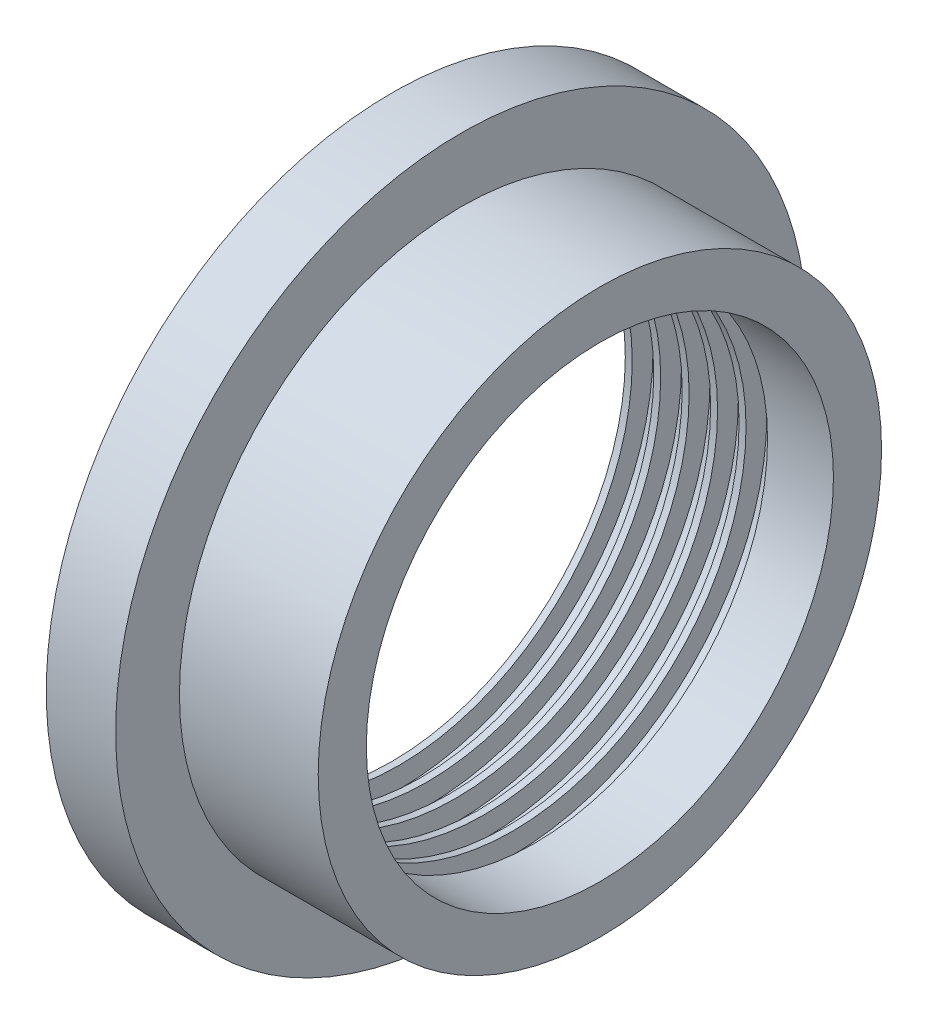
ISO-10303-21;
HEADER;
FILE_DESCRIPTION(('STEP AP214'),'2;1');
FILE_NAME('part.step','',(''),(''),'','','');
FILE_SCHEMA(('AUTOMOTIVE_DESIGN { 1 0 10303 214 1 1 1 1 }'));
ENDSEC;
DATA;
#1=APPLICATION_CONTEXT('core data for automotive mechanical design processes');
#2=APPLICATION_PROTOCOL_DEFINITION('international standard','automotive_design',2000,#1);
#3=PRODUCT_CONTEXT('',#1,'mechanical');
#4=PRODUCT('Part','Part','',(#3));
#5=PRODUCT_RELATED_PRODUCT_CATEGORY('part','',(#4));
#6=PRODUCT_DEFINITION_FORMATION('','',#4);
#7=PRODUCT_DEFINITION_CONTEXT('part definition',#1,'design');
#8=PRODUCT_DEFINITION('design','',#6,#7);
#9=PRODUCT_DEFINITION_SHAPE('','',#8);
#10=(LENGTH_UNIT() NAMED_UNIT(*) SI_UNIT(.MILLI.,.METRE.));
#11=(NAMED_UNIT(*) PLANE_ANGLE_UNIT() SI_UNIT($,.RADIAN.));
#12=(NAMED_UNIT(*) SI_UNIT($,.STERADIAN.) SOLID_ANGLE_UNIT());
#13=UNCERTAINTY_MEASURE_WITH_UNIT(LENGTH_MEASURE(1.E-05),#10,'distance_accuracy_value','');
#14=(GEOMETRIC_REPRESENTATION_CONTEXT(3) GLOBAL_UNCERTAINTY_ASSIGNED_CONTEXT((#13)) GLOBAL_UNIT_ASSIGNED_CONTEXT((#10,
#11,#12)) REPRESENTATION_CONTEXT('',''));
#15=CARTESIAN_POINT('',(0.,0.,0.));
#16=DIRECTION('',(0.,0.,1.));
#17=DIRECTION('',(1.,0.,0.));
#18=AXIS2_PLACEMENT_3D('',#15,#16,#17);
#19=CARTESIAN_POINT('',(0.,0.,0.));
#20=DIRECTION('',(1.,0.,0.));
#21=DIRECTION('',(0.,0.,-1.));
#22=AXIS2_PLACEMENT_3D('',#19,#20,#21);
#23=CYLINDRICAL_SURFACE('',#22,12.6492);
#24=CARTESIAN_POINT('',(-7.62,0.,0.));
#25=DIRECTION('',(1.,0.,0.));
#26=DIRECTION('',(0.,0.,-1.));
#27=AXIS2_PLACEMENT_3D('',#24,#25,#26);
#28=CIRCLE('',#27,12.6492);
#29=CARTESIAN_POINT('',(-7.62,0.,-12.6492));
#30=VERTEX_POINT('',#29);
#31=EDGE_CURVE('E10',#30,#30,#28,.T.);
#32=ORIENTED_EDGE('',*,*,#31,.T.);
#33=EDGE_LOOP('',(#32));
#34=FACE_BOUND('',#33,.T.);
#35=CARTESIAN_POINT('',(-5.08,0.,0.));
#36=DIRECTION('',(1.,0.,0.));
#37=DIRECTION('',(0.,0.,-1.));
#38=AXIS2_PLACEMENT_3D('',#35,#36,#37);
#39=CIRCLE('',#38,12.6492);
#40=CARTESIAN_POINT('',(-5.08,0.,-12.6492));
#41=VERTEX_POINT('',#40);
#42=EDGE_CURVE('E118',#41,#41,#39,.T.);
#43=ORIENTED_EDGE('',*,*,#42,.F.);
#44=EDGE_LOOP('',(#43));
#45=FACE_BOUND('',#44,.T.);
#46=ADVANCED_FACE('F36',(#34,#45),#23,.T.);
#47=CARTESIAN_POINT('',(-7.62,12.6492,0.));
#48=DIRECTION('',(-1.,0.,0.));
#49=DIRECTION('',(0.,0.,1.));
#50=AXIS2_PLACEMENT_3D('',#47,#48,#49);
#51=PLANE('',#50);
#52=CARTESIAN_POINT('',(-7.62,0.,0.));
#53=DIRECTION('',(1.,0.,0.));
#54=DIRECTION('',(0.,0.,-1.));
#55=AXIS2_PLACEMENT_3D('',#52,#53,#54);
#56=CIRCLE('',#55,8.550800018);
#57=CARTESIAN_POINT('',(-7.62,0.,-8.550800018));
#58=VERTEX_POINT('',#57);
#59=EDGE_CURVE('E42',#58,#58,#56,.T.);
#60=ORIENTED_EDGE('',*,*,#59,.T.);
#61=EDGE_LOOP('',(#60));
#62=FACE_BOUND('',#61,.T.);
#63=ORIENTED_EDGE('',*,*,#31,.F.);
#64=EDGE_LOOP('',(#63));
#65=FACE_BOUND('',#64,.T.);
#66=ADVANCED_FACE('F126',(#62,#65),#51,.T.);
#67=CARTESIAN_POINT('',(0.,0.,0.));
#68=DIRECTION('',(1.,0.,0.));
#69=DIRECTION('',(0.,0.,-1.));
#70=AXIS2_PLACEMENT_3D('',#67,#68,#69);
#71=CYLINDRICAL_SURFACE('',#70,8.550800018);
#72=CARTESIAN_POINT('',(-7.366,0.,0.));
#73=DIRECTION('',(1.,0.,0.));
#74=DIRECTION('',(0.,0.,-1.));
#75=AXIS2_PLACEMENT_3D('',#72,#73,#74);
#76=CIRCLE('',#75,8.550800018);
#77=CARTESIAN_POINT('',(-7.366,0.,-8.550800018));
#78=VERTEX_POINT('',#77);
#79=EDGE_CURVE('E46',#78,#78,#76,.T.);
#80=ORIENTED_EDGE('',*,*,#79,.T.);
#81=EDGE_LOOP('',(#80));
#82=FACE_BOUND('',#81,.T.);
#83=ORIENTED_EDGE('',*,*,#59,.F.);
#84=EDGE_LOOP('',(#83));
#85=FACE_BOUND('',#84,.T.);
#86=ADVANCED_FACE('F130',(#82,#85),#71,.F.);
#87=CARTESIAN_POINT('',(-7.366,8.550800018,0.));
#88=DIRECTION('',(1.,0.,0.));
#89=DIRECTION('',(0.,0.,-1.));
#90=AXIS2_PLACEMENT_3D('',#87,#88,#89);
#91=PLANE('',#90);
#92=CARTESIAN_POINT('',(-7.366,0.,0.));
#93=DIRECTION('',(1.,0.,0.));
#94=DIRECTION('',(0.,0.,-1.));
#95=AXIS2_PLACEMENT_3D('',#92,#93,#94);
#96=CIRCLE('',#95,9.312800018);
#97=CARTESIAN_POINT('',(-7.366,0.,-9.312800018));
#98=VERTEX_POINT('',#97);
#99=EDGE_CURVE('E50',#98,#98,#96,.T.);
#100=ORIENTED_EDGE('',*,*,#99,.T.);
#101=EDGE_LOOP('',(#100));
#102=FACE_BOUND('',#101,.T.);
#103=ORIENTED_EDGE('',*,*,#79,.F.);
#104=EDGE_LOOP('',(#103));
#105=FACE_BOUND('',#104,.T.);
#106=ADVANCED_FACE('F134',(#102,#105),#91,.T.);
#107=CARTESIAN_POINT('',(0.,0.,0.));
#108=DIRECTION('',(1.,0.,0.));
#109=DIRECTION('',(0.,0.,-1.));
#110=AXIS2_PLACEMENT_3D('',#107,#108,#109);
#111=CYLINDRICAL_SURFACE('',#110,9.312800018);
#112=CARTESIAN_POINT('',(-6.5786,0.,0.));
#113=DIRECTION('',(1.,0.,0.));
#114=DIRECTION('',(0.,0.,-1.));
#115=AXIS2_PLACEMENT_3D('',#112,#113,#114);
#116=CIRCLE('',#115,9.312800018);
#117=CARTESIAN_POINT('',(-6.5786,0.,-9.312800018));
#118=VERTEX_POINT('',#117);
#119=EDGE_CURVE('E55',#118,#118,#116,.T.);
#120=ORIENTED_EDGE('',*,*,#119,.T.);
#121=EDGE_LOOP('',(#120));
#122=FACE_BOUND('',#121,.T.);
#123=ORIENTED_EDGE('',*,*,#99,.F.);
#124=EDGE_LOOP('',(#123));
#125=FACE_BOUND('',#124,.T.);
#126=ADVANCED_FACE('F141',(#122,#125),#111,.F.);
#127=CARTESIAN_POINT('',(-6.5786,9.312800018,0.));
#128=DIRECTION('',(-1.,0.,0.));
#129=DIRECTION('',(0.,0.,1.));
#130=AXIS2_PLACEMENT_3D('',#127,#128,#129);
#131=PLANE('',#130);
#132=CARTESIAN_POINT('',(-6.5786,0.,0.));
#133=DIRECTION('',(1.,0.,0.));
#134=DIRECTION('',(0.,0.,-1.));
#135=AXIS2_PLACEMENT_3D('',#132,#133,#134);
#136=CIRCLE('',#135,8.550800018);
#137=CARTESIAN_POINT('',(-6.5786,0.,-8.550800018));
#138=VERTEX_POINT('',#137);
#139=EDGE_CURVE('E58',#138,#138,#136,.T.);
#140=ORIENTED_EDGE('',*,*,#139,.T.);
#141=EDGE_LOOP('',(#140));
#142=FACE_BOUND('',#141,.T.);
#143=ORIENTED_EDGE('',*,*,#119,.F.);
#144=EDGE_LOOP('',(#143));
#145=FACE_BOUND('',#144,.T.);
#146=ADVANCED_FACE('F145',(#142,#145),#131,.T.);
#147=CARTESIAN_POINT('',(0.,0.,0.));
#148=DIRECTION('',(1.,0.,0.));
#149=DIRECTION('',(0.,0.,-1.));
#150=AXIS2_PLACEMENT_3D('',#147,#148,#149);
#151=CYLINDRICAL_SURFACE('',#150,8.550800018);
#152=CARTESIAN_POINT('',(-6.3246,0.,0.));
#153=DIRECTION('',(1.,0.,0.));
#154=DIRECTION('',(0.,0.,-1.));
#155=AXIS2_PLACEMENT_3D('',#152,#153,#154);
#156=CIRCLE('',#155,8.550800018);
#157=CARTESIAN_POINT('',(-6.3246,0.,-8.550800018));
#158=VERTEX_POINT('',#157);
#159=EDGE_CURVE('E61',#158,#158,#156,.T.);
#160=ORIENTED_EDGE('',*,*,#159,.T.);
#161=EDGE_LOOP('',(#160));
#162=FACE_BOUND('',#161,.T.);
#163=ORIENTED_EDGE('',*,*,#139,.F.);
#164=EDGE_LOOP('',(#163));
#165=FACE_BOUND('',#164,.T.);
#166=ADVANCED_FACE('F149',(#162,#165),#151,.F.);
#167=CARTESIAN_POINT('',(-6.3246,8.550800018,0.));
#168=DIRECTION('',(1.,0.,0.));
#169=DIRECTION('',(0.,0.,-1.));
#170=AXIS2_PLACEMENT_3D('',#167,#168,#169);
#171=PLANE('',#170);
#172=CARTESIAN_POINT('',(-6.3246,0.,0.));
#173=DIRECTION('',(1.,0.,0.));
#174=DIRECTION('',(0.,0.,-1.));
#175=AXIS2_PLACEMENT_3D('',#172,#173,#174);
#176=CIRCLE('',#175,9.312800018);
#177=CARTESIAN_POINT('',(-6.3246,0.,-9.312800018));
#178=VERTEX_POINT('',#177);
#179=EDGE_CURVE('E64',#178,#178,#176,.T.);
#180=ORIENTED_EDGE('',*,*,#179,.T.);
#181=EDGE_LOOP('',(#180));
#182=FACE_BOUND('',#181,.T.);
#183=ORIENTED_EDGE('',*,*,#159,.F.);
#184=EDGE_LOOP('',(#183));
#185=FACE_BOUND('',#184,.T.);
#186=ADVANCED_FACE('F153',(#182,#185),#171,.T.);
#187=CARTESIAN_POINT('',(0.,0.,0.));
#188=DIRECTION('',(1.,0.,0.));
#189=DIRECTION('',(0.,0.,-1.));
#190=AXIS2_PLACEMENT_3D('',#187,#188,#189);
#191=CYLINDRICAL_SURFACE('',#190,9.312800018);
#192=CARTESIAN_POINT('',(-5.5372,0.,0.));
#193=DIRECTION('',(1.,0.,0.));
#194=DIRECTION('',(0.,0.,-1.));
#195=AXIS2_PLACEMENT_3D('',#192,#193,#194);
#196=CIRCLE('',#195,9.312800018);
#197=CARTESIAN_POINT('',(-5.5372,0.,-9.312800018));
#198=VERTEX_POINT('',#197);
#199=EDGE_CURVE('E67',#198,#198,#196,.T.);
#200=ORIENTED_EDGE('',*,*,#199,.T.);
#201=EDGE_LOOP('',(#200));
#202=FACE_BOUND('',#201,.T.);
#203=ORIENTED_EDGE('',*,*,#179,.F.);
#204=EDGE_LOOP('',(#203));
#205=FACE_BOUND('',#204,.T.);
#206=ADVANCED_FACE('F157',(#202,#205),#191,.F.);
#207=CARTESIAN_POINT('',(-5.5372,9.312800018,0.));
#208=DIRECTION('',(-1.,0.,0.));
#209=DIRECTION('',(0.,0.,1.));
#210=AXIS2_PLACEMENT_3D('',#207,#208,#209);
#211=PLANE('',#210);
#212=CARTESIAN_POINT('',(-5.5372,0.,0.));
#213=DIRECTION('',(1.,0.,0.));
#214=DIRECTION('',(0.,0.,-1.));
#215=AXIS2_PLACEMENT_3D('',#212,#213,#214);
#216=CIRCLE('',#215,8.550800018);
#217=CARTESIAN_POINT('',(-5.5372,0.,-8.550800018));
#218=VERTEX_POINT('',#217);
#219=EDGE_CURVE('E70',#218,#218,#216,.T.);
#220=ORIENTED_EDGE('',*,*,#219,.T.);
#221=EDGE_LOOP('',(#220));
#222=FACE_BOUND('',#221,.T.);
#223=ORIENTED_EDGE('',*,*,#199,.F.);
#224=EDGE_LOOP('',(#223));
#225=FACE_BOUND('',#224,.T.);
#226=ADVANCED_FACE('F161',(#222,#225),#211,.T.);
#227=CARTESIAN_POINT('',(0.,0.,0.));
#228=DIRECTION('',(1.,0.,0.));
#229=DIRECTION('',(0.,0.,-1.));
#230=AXIS2_PLACEMENT_3D('',#227,#228,#229);
#231=CYLINDRICAL_SURFACE('',#230,8.550800018);
#232=CARTESIAN_POINT('',(-5.2832,0.,0.));
#233=DIRECTION('',(1.,0.,0.));
#234=DIRECTION('',(0.,0.,-1.));
#235=AXIS2_PLACEMENT_3D('',#232,#233,#234);
#236=CIRCLE('',#235,8.550800018);
#237=CARTESIAN_POINT('',(-5.2832,0.,-8.550800018));
#238=VERTEX_POINT('',#237);
#239=EDGE_CURVE('E73',#238,#238,#236,.T.);
#240=ORIENTED_EDGE('',*,*,#239,.T.);
#241=EDGE_LOOP('',(#240));
#242=FACE_BOUND('',#241,.T.);
#243=ORIENTED_EDGE('',*,*,#219,.F.);
#244=EDGE_LOOP('',(#243));
#245=FACE_BOUND('',#244,.T.);
#246=ADVANCED_FACE('F165',(#242,#245),#231,.F.);
#247=CARTESIAN_POINT('',(-5.2832,8.550800018,0.));
#248=DIRECTION('',(1.,0.,0.));
#249=DIRECTION('',(0.,0.,-1.));
#250=AXIS2_PLACEMENT_3D('',#247,#248,#249);
#251=PLANE('',#250);
#252=CARTESIAN_POINT('',(-5.2832,0.,0.));
#253=DIRECTION('',(1.,0.,0.));
#254=DIRECTION('',(0.,0.,-1.));
#255=AXIS2_PLACEMENT_3D('',#252,#253,#254);
#256=CIRCLE('',#255,9.312800018);
#257=CARTESIAN_POINT('',(-5.2832,0.,-9.312800018));
#258=VERTEX_POINT('',#257);
#259=EDGE_CURVE('E76',#258,#258,#256,.T.);
#260=ORIENTED_EDGE('',*,*,#259,.T.);
#261=EDGE_LOOP('',(#260));
#262=FACE_BOUND('',#261,.T.);
#263=ORIENTED_EDGE('',*,*,#239,.F.);
#264=EDGE_LOOP('',(#263));
#265=FACE_BOUND('',#264,.T.);
#266=ADVANCED_FACE('F169',(#262,#265),#251,.T.);
#267=CARTESIAN_POINT('',(0.,0.,0.));
#268=DIRECTION('',(1.,0.,0.));
#269=DIRECTION('',(0.,0.,-1.));
#270=AXIS2_PLACEMENT_3D('',#267,#268,#269);
#271=CYLINDRICAL_SURFACE('',#270,9.312800018);
#272=CARTESIAN_POINT('',(-4.4958,0.,0.));
#273=DIRECTION('',(1.,0.,0.));
#274=DIRECTION('',(0.,0.,-1.));
#275=AXIS2_PLACEMENT_3D('',#272,#273,#274);
#276=CIRCLE('',#275,9.312800018);
#277=CARTESIAN_POINT('',(-4.4958,0.,-9.312800018));
#278=VERTEX_POINT('',#277);
#279=EDGE_CURVE('E79',#278,#278,#276,.T.);
#280=ORIENTED_EDGE('',*,*,#279,.T.);
#281=EDGE_LOOP('',(#280));
#282=FACE_BOUND('',#281,.T.);
#283=ORIENTED_EDGE('',*,*,#259,.F.);
#284=EDGE_LOOP('',(#283));
#285=FACE_BOUND('',#284,.T.);
#286=ADVANCED_FACE('F173',(#282,#285),#271,.F.);
#287=CARTESIAN_POINT('',(-4.4958,9.312800018,0.));
#288=DIRECTION('',(-1.,0.,0.));
#289=DIRECTION('',(0.,0.,1.));
#290=AXIS2_PLACEMENT_3D('',#287,#288,#289);
#291=PLANE('',#290);
#292=CARTESIAN_POINT('',(-4.4958,0.,0.));
#293=DIRECTION('',(1.,0.,0.));
#294=DIRECTION('',(0.,0.,-1.));
#295=AXIS2_PLACEMENT_3D('',#292,#293,#294);
#296=CIRCLE('',#295,8.550800018);
#297=CARTESIAN_POINT('',(-4.4958,0.,-8.550800018));
#298=VERTEX_POINT('',#297);
#299=EDGE_CURVE('E82',#298,#298,#296,.T.);
#300=ORIENTED_EDGE('',*,*,#299,.T.);
#301=EDGE_LOOP('',(#300));
#302=FACE_BOUND('',#301,.T.);
#303=ORIENTED_EDGE('',*,*,#279,.F.);
#304=EDGE_LOOP('',(#303));
#305=FACE_BOUND('',#304,.T.);
#306=ADVANCED_FACE('F177',(#302,#305),#291,.T.);
#307=CARTESIAN_POINT('',(0.,0.,0.));
#308=DIRECTION('',(1.,0.,0.));
#309=DIRECTION('',(0.,0.,-1.));
#310=AXIS2_PLACEMENT_3D('',#307,#308,#309);
#311=CYLINDRICAL_SURFACE('',#310,8.550800018);
#312=CARTESIAN_POINT('',(-4.2418,0.,0.));
#313=DIRECTION('',(1.,0.,0.));
#314=DIRECTION('',(0.,0.,-1.));
#315=AXIS2_PLACEMENT_3D('',#312,#313,#314);
#316=CIRCLE('',#315,8.550800018);
#317=CARTESIAN_POINT('',(-4.2418,0.,-8.550800018));
#318=VERTEX_POINT('',#317);
#319=EDGE_CURVE('E85',#318,#318,#316,.T.);
#320=ORIENTED_EDGE('',*,*,#319,.T.);
#321=EDGE_LOOP('',(#320));
#322=FACE_BOUND('',#321,.T.);
#323=ORIENTED_EDGE('',*,*,#299,.F.);
#324=EDGE_LOOP('',(#323));
#325=FACE_BOUND('',#324,.T.);
#326=ADVANCED_FACE('F181',(#322,#325),#311,.F.);
#327=CARTESIAN_POINT('',(-4.2418,8.550800018,0.));
#328=DIRECTION('',(1.,0.,0.));
#329=DIRECTION('',(0.,0.,-1.));
#330=AXIS2_PLACEMENT_3D('',#327,#328,#329);
#331=PLANE('',#330);
#332=CARTESIAN_POINT('',(-4.2418,0.,0.));
#333=DIRECTION('',(1.,0.,0.));
#334=DIRECTION('',(0.,0.,-1.));
#335=AXIS2_PLACEMENT_3D('',#332,#333,#334);
#336=CIRCLE('',#335,9.312800018);
#337=CARTESIAN_POINT('',(-4.2418,0.,-9.312800018));
#338=VERTEX_POINT('',#337);
#339=EDGE_CURVE('E88',#338,#338,#336,.T.);
#340=ORIENTED_EDGE('',*,*,#339,.T.);
#341=EDGE_LOOP('',(#340));
#342=FACE_BOUND('',#341,.T.);
#343=ORIENTED_EDGE('',*,*,#319,.F.);
#344=EDGE_LOOP('',(#343));
#345=FACE_BOUND('',#344,.T.);
#346=ADVANCED_FACE('F185',(#342,#345),#331,.T.);
#347=CARTESIAN_POINT('',(0.,0.,0.));
#348=DIRECTION('',(1.,0.,0.));
#349=DIRECTION('',(0.,0.,-1.));
#350=AXIS2_PLACEMENT_3D('',#347,#348,#349);
#351=CYLINDRICAL_SURFACE('',#350,9.312800018);
#352=CARTESIAN_POINT('',(-3.4544,0.,0.));
#353=DIRECTION('',(1.,0.,0.));
#354=DIRECTION('',(0.,0.,-1.));
#355=AXIS2_PLACEMENT_3D('',#352,#353,#354);
#356=CIRCLE('',#355,9.312800018);
#357=CARTESIAN_POINT('',(-3.4544,0.,-9.312800018));
#358=VERTEX_POINT('',#357);
#359=EDGE_CURVE('E91',#358,#358,#356,.T.);
#360=ORIENTED_EDGE('',*,*,#359,.T.);
#361=EDGE_LOOP('',(#360));
#362=FACE_BOUND('',#361,.T.);
#363=ORIENTED_EDGE('',*,*,#339,.F.);
#364=EDGE_LOOP('',(#363));
#365=FACE_BOUND('',#364,.T.);
#366=ADVANCED_FACE('F189',(#362,#365),#351,.F.);
#367=CARTESIAN_POINT('',(-3.4544,9.312800018,0.));
#368=DIRECTION('',(-1.,0.,0.));
#369=DIRECTION('',(0.,0.,1.));
#370=AXIS2_PLACEMENT_3D('',#367,#368,#369);
#371=PLANE('',#370);
#372=CARTESIAN_POINT('',(-3.4544,0.,0.));
#373=DIRECTION('',(1.,0.,0.));
#374=DIRECTION('',(0.,0.,-1.));
#375=AXIS2_PLACEMENT_3D('',#372,#373,#374);
#376=CIRCLE('',#375,8.550800018);
#377=CARTESIAN_POINT('',(-3.4544,0.,-8.550800018));
#378=VERTEX_POINT('',#377);
#379=EDGE_CURVE('E94',#378,#378,#376,.T.);
#380=ORIENTED_EDGE('',*,*,#379,.T.);
#381=EDGE_LOOP('',(#380));
#382=FACE_BOUND('',#381,.T.);
#383=ORIENTED_EDGE('',*,*,#359,.F.);
#384=EDGE_LOOP('',(#383));
#385=FACE_BOUND('',#384,.T.);
#386=ADVANCED_FACE('F193',(#382,#385),#371,.T.);
#387=CARTESIAN_POINT('',(0.,0.,0.));
#388=DIRECTION('',(1.,0.,0.));
#389=DIRECTION('',(0.,0.,-1.));
#390=AXIS2_PLACEMENT_3D('',#387,#388,#389);
#391=CYLINDRICAL_SURFACE('',#390,8.550800018);
#392=CARTESIAN_POINT('',(-3.2004,0.,0.));
#393=DIRECTION('',(1.,0.,0.));
#394=DIRECTION('',(0.,0.,-1.));
#395=AXIS2_PLACEMENT_3D('',#392,#393,#394);
#396=CIRCLE('',#395,8.550800018);
#397=CARTESIAN_POINT('',(-3.2004,0.,-8.550800018));
#398=VERTEX_POINT('',#397);
#399=EDGE_CURVE('E97',#398,#398,#396,.T.);
#400=ORIENTED_EDGE('',*,*,#399,.T.);
#401=EDGE_LOOP('',(#400));
#402=FACE_BOUND('',#401,.T.);
#403=ORIENTED_EDGE('',*,*,#379,.F.);
#404=EDGE_LOOP('',(#403));
#405=FACE_BOUND('',#404,.T.);
#406=ADVANCED_FACE('F197',(#402,#405),#391,.F.);
#407=CARTESIAN_POINT('',(-3.2004,8.550800018,0.));
#408=DIRECTION('',(1.,0.,0.));
#409=DIRECTION('',(0.,0.,-1.));
#410=AXIS2_PLACEMENT_3D('',#407,#408,#409);
#411=PLANE('',#410);
#412=CARTESIAN_POINT('',(-3.2004,0.,0.));
#413=DIRECTION('',(1.,0.,0.));
#414=DIRECTION('',(0.,0.,-1.));
#415=AXIS2_PLACEMENT_3D('',#412,#413,#414);
#416=CIRCLE('',#415,9.312800018);
#417=CARTESIAN_POINT('',(-3.2004,0.,-9.312800018));
#418=VERTEX_POINT('',#417);
#419=EDGE_CURVE('E100',#418,#418,#416,.T.);
#420=ORIENTED_EDGE('',*,*,#419,.T.);
#421=EDGE_LOOP('',(#420));
#422=FACE_BOUND('',#421,.T.);
#423=ORIENTED_EDGE('',*,*,#399,.F.);
#424=EDGE_LOOP('',(#423));
#425=FACE_BOUND('',#424,.T.);
#426=ADVANCED_FACE('F201',(#422,#425),#411,.T.);
#427=CARTESIAN_POINT('',(0.,0.,0.));
#428=DIRECTION('',(1.,0.,0.));
#429=DIRECTION('',(0.,0.,-1.));
#430=AXIS2_PLACEMENT_3D('',#427,#428,#429);
#431=CYLINDRICAL_SURFACE('',#430,9.312800018);
#432=CARTESIAN_POINT('',(-2.413,0.,0.));
#433=DIRECTION('',(1.,0.,0.));
#434=DIRECTION('',(0.,0.,-1.));
#435=AXIS2_PLACEMENT_3D('',#432,#433,#434);
#436=CIRCLE('',#435,9.312800018);
#437=CARTESIAN_POINT('',(-2.413,0.,-9.312800018));
#438=VERTEX_POINT('',#437);
#439=EDGE_CURVE('E103',#438,#438,#436,.T.);
#440=ORIENTED_EDGE('',*,*,#439,.T.);
#441=EDGE_LOOP('',(#440));
#442=FACE_BOUND('',#441,.T.);
#443=ORIENTED_EDGE('',*,*,#419,.F.);
#444=EDGE_LOOP('',(#443));
#445=FACE_BOUND('',#444,.T.);
#446=ADVANCED_FACE('F205',(#442,#445),#431,.F.);
#447=CARTESIAN_POINT('',(-2.413,9.312800018,0.));
#448=DIRECTION('',(-1.,0.,0.));
#449=DIRECTION('',(0.,0.,1.));
#450=AXIS2_PLACEMENT_3D('',#447,#448,#449);
#451=PLANE('',#450);
#452=CARTESIAN_POINT('',(-2.413,0.,0.));
#453=DIRECTION('',(1.,0.,0.));
#454=DIRECTION('',(0.,0.,-1.));
#455=AXIS2_PLACEMENT_3D('',#452,#453,#454);
#456=CIRCLE('',#455,8.550800018);
#457=CARTESIAN_POINT('',(-2.413,0.,-8.550800018));
#458=VERTEX_POINT('',#457);
#459=EDGE_CURVE('E106',#458,#458,#456,.T.);
#460=ORIENTED_EDGE('',*,*,#459,.T.);
#461=EDGE_LOOP('',(#460));
#462=FACE_BOUND('',#461,.T.);
#463=ORIENTED_EDGE('',*,*,#439,.F.);
#464=EDGE_LOOP('',(#463));
#465=FACE_BOUND('',#464,.T.);
#466=ADVANCED_FACE('F209',(#462,#465),#451,.T.);
#467=CARTESIAN_POINT('',(0.,0.,0.));
#468=DIRECTION('',(1.,0.,0.));
#469=DIRECTION('',(0.,0.,-1.));
#470=AXIS2_PLACEMENT_3D('',#467,#468,#469);
#471=CYLINDRICAL_SURFACE('',#470,8.550800018);
#472=CARTESIAN_POINT('',(0.,0.,0.));
#473=DIRECTION('',(1.,0.,0.));
#474=DIRECTION('',(0.,0.,-1.));
#475=AXIS2_PLACEMENT_3D('',#472,#473,#474);
#476=CIRCLE('',#475,8.550800018);
#477=CARTESIAN_POINT('',(0.,0.,-8.550800018));
#478=VERTEX_POINT('',#477);
#479=EDGE_CURVE('E109',#478,#478,#476,.T.);
#480=ORIENTED_EDGE('',*,*,#479,.T.);
#481=EDGE_LOOP('',(#480));
#482=FACE_BOUND('',#481,.T.);
#483=ORIENTED_EDGE('',*,*,#459,.F.);
#484=EDGE_LOOP('',(#483));
#485=FACE_BOUND('',#484,.T.);
#486=ADVANCED_FACE('F213',(#482,#485),#471,.F.);
#487=CARTESIAN_POINT('',(0.,8.550800018,0.));
#488=DIRECTION('',(1.,0.,0.));
#489=DIRECTION('',(0.,0.,-1.));
#490=AXIS2_PLACEMENT_3D('',#487,#488,#489);
#491=PLANE('',#490);
#492=CARTESIAN_POINT('',(0.,0.,0.));
#493=DIRECTION('',(1.,0.,0.));
#494=DIRECTION('',(0.,0.,-1.));
#495=AXIS2_PLACEMENT_3D('',#492,#493,#494);
#496=CIRCLE('',#495,10.3124);
#497=CARTESIAN_POINT('',(0.,0.,-10.3124));
#498=VERTEX_POINT('',#497);
#499=EDGE_CURVE('E112',#498,#498,#496,.T.);
#500=ORIENTED_EDGE('',*,*,#499,.T.);
#501=EDGE_LOOP('',(#500));
#502=FACE_BOUND('',#501,.T.);
#503=ORIENTED_EDGE('',*,*,#479,.F.);
#504=EDGE_LOOP('',(#503));
#505=FACE_BOUND('',#504,.T.);
#506=ADVANCED_FACE('F217',(#502,#505),#491,.T.);
#507=CARTESIAN_POINT('',(0.,0.,0.));
#508=DIRECTION('',(1.,0.,0.));
#509=DIRECTION('',(0.,0.,-1.));
#510=AXIS2_PLACEMENT_3D('',#507,#508,#509);
#511=CYLINDRICAL_SURFACE('',#510,10.3124);
#512=CARTESIAN_POINT('',(-5.08,0.,0.));
#513=DIRECTION('',(1.,0.,0.));
#514=DIRECTION('',(0.,0.,-1.));
#515=AXIS2_PLACEMENT_3D('',#512,#513,#514);
#516=CIRCLE('',#515,10.3124);
#517=CARTESIAN_POINT('',(-5.08,0.,-10.3124));
#518=VERTEX_POINT('',#517);
#519=EDGE_CURVE('E115',#518,#518,#516,.T.);
#520=ORIENTED_EDGE('',*,*,#519,.T.);
#521=EDGE_LOOP('',(#520));
#522=FACE_BOUND('',#521,.T.);
#523=ORIENTED_EDGE('',*,*,#499,.F.);
#524=EDGE_LOOP('',(#523));
#525=FACE_BOUND('',#524,.T.);
#526=ADVANCED_FACE('F221',(#522,#525),#511,.T.);
#527=CARTESIAN_POINT('',(-5.08,10.3124,0.));
#528=DIRECTION('',(1.,0.,0.));
#529=DIRECTION('',(0.,0.,-1.));
#530=AXIS2_PLACEMENT_3D('',#527,#528,#529);
#531=PLANE('',#530);
#532=ORIENTED_EDGE('',*,*,#42,.T.);
#533=EDGE_LOOP('',(#532));
#534=FACE_BOUND('',#533,.T.);
#535=ORIENTED_EDGE('',*,*,#519,.F.);
#536=EDGE_LOOP('',(#535));
#537=FACE_BOUND('',#536,.T.);
#538=ADVANCED_FACE('F122',(#534,#537),#531,.T.);
#539=CLOSED_SHELL('',(#46,#66,#86,#106,#126,#146,#166,#186,#206,#226,#246,#266,#286,#306,#326,
#346,#366,#386,#406,#426,#446,#466,#486,#506,#526,#538));
#540=MANIFOLD_SOLID_BREP('B2',#539);
#541=ADVANCED_BREP_SHAPE_REPRESENTATION('',(#18,#540),#14);
#542=SHAPE_DEFINITION_REPRESENTATION(#9,#541);
ENDSEC;
END-ISO-10303-21;
